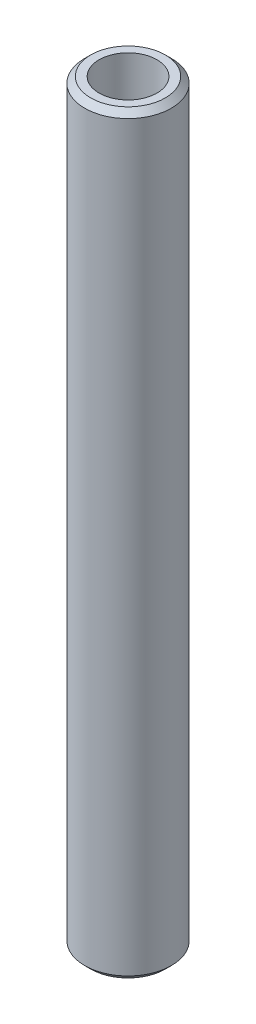
ISO-10303-21;
HEADER;
FILE_DESCRIPTION(('STEP AP214'),'2;1');
FILE_NAME('part.step','',(''),(''),'','','');
FILE_SCHEMA(('AUTOMOTIVE_DESIGN { 1 0 10303 214 1 1 1 1 }'));
ENDSEC;
DATA;
#1=APPLICATION_CONTEXT('core data for automotive mechanical design processes');
#2=APPLICATION_PROTOCOL_DEFINITION('international standard','automotive_design',2000,#1);
#3=PRODUCT_CONTEXT('',#1,'mechanical');
#4=PRODUCT('Part','Part','',(#3));
#5=PRODUCT_RELATED_PRODUCT_CATEGORY('part','',(#4));
#6=PRODUCT_DEFINITION_FORMATION('','',#4);
#7=PRODUCT_DEFINITION_CONTEXT('part definition',#1,'design');
#8=PRODUCT_DEFINITION('design','',#6,#7);
#9=PRODUCT_DEFINITION_SHAPE('','',#8);
#10=(LENGTH_UNIT() NAMED_UNIT(*) SI_UNIT(.MILLI.,.METRE.));
#11=(NAMED_UNIT(*) PLANE_ANGLE_UNIT() SI_UNIT($,.RADIAN.));
#12=(NAMED_UNIT(*) SI_UNIT($,.STERADIAN.) SOLID_ANGLE_UNIT());
#13=UNCERTAINTY_MEASURE_WITH_UNIT(LENGTH_MEASURE(1.E-05),#10,'distance_accuracy_value','');
#14=(GEOMETRIC_REPRESENTATION_CONTEXT(3) GLOBAL_UNCERTAINTY_ASSIGNED_CONTEXT((#13)) GLOBAL_UNIT_ASSIGNED_CONTEXT((#10,
#11,#12)) REPRESENTATION_CONTEXT('',''));
#15=CARTESIAN_POINT('',(0.,0.,0.));
#16=DIRECTION('',(0.,0.,1.));
#17=DIRECTION('',(1.,0.,0.));
#18=AXIS2_PLACEMENT_3D('',#15,#16,#17);
#19=CARTESIAN_POINT('',(0.,435.950441471467,0.));
#20=DIRECTION('',(0.,-1.,0.));
#21=DIRECTION('',(0.,0.,-1.));
#22=AXIS2_PLACEMENT_3D('',#19,#20,#21);
#23=CYLINDRICAL_SURFACE('',#22,25.);
#24=CARTESIAN_POINT('',(0.,432.499623451648,0.));
#25=DIRECTION('',(0.,1.,0.));
#26=DIRECTION('',(0.,0.,1.));
#27=AXIS2_PLACEMENT_3D('',#24,#25,#26);
#28=CIRCLE('',#27,25.);
#29=CARTESIAN_POINT('',(0.,432.499623451648,-25.));
#30=VERTEX_POINT('',#29);
#31=EDGE_CURVE('E50',#30,#30,#28,.F.);
#32=CARTESIAN_POINT('',(0.,3.45081801981934,0.));
#33=DIRECTION('',(0.,1.,0.));
#34=DIRECTION('',(0.,0.,1.));
#35=AXIS2_PLACEMENT_3D('',#32,#33,#34);
#36=CIRCLE('',#35,25.);
#37=CARTESIAN_POINT('',(0.,3.45081801981934,-25.));
#38=VERTEX_POINT('',#37);
#39=EDGE_CURVE('E51',#38,#38,#36,.T.);
#40=CARTESIAN_POINT('',(0.,432.499623451648,-25.));
#41=CARTESIAN_POINT('',(0.,428.030365061733,-25.));
#42=CARTESIAN_POINT('',(0.,423.561106671819,-25.));
#43=CARTESIAN_POINT('',(0.,414.622589891989,-25.));
#44=CARTESIAN_POINT('',(0.,410.153331502074,-25.));
#45=CARTESIAN_POINT('',(0.,401.214814722244,-25.));
#46=CARTESIAN_POINT('',(0.,396.745556332329,-25.));
#47=CARTESIAN_POINT('',(0.,387.8070395525,-25.));
#48=CARTESIAN_POINT('',(0.,383.337781162585,-25.));
#49=CARTESIAN_POINT('',(0.,374.399264382755,-25.));
#50=CARTESIAN_POINT('',(0.,369.93000599284,-25.));
#51=CARTESIAN_POINT('',(0.,360.99148921301,-25.));
#52=CARTESIAN_POINT('',(0.,356.522230823095,-25.));
#53=CARTESIAN_POINT('',(0.,347.583714043266,-25.));
#54=CARTESIAN_POINT('',(0.,343.114455653351,-25.));
#55=CARTESIAN_POINT('',(0.,334.175938873521,-25.));
#56=CARTESIAN_POINT('',(0.,329.706680483606,-25.));
#57=CARTESIAN_POINT('',(0.,320.768163703776,-25.));
#58=CARTESIAN_POINT('',(0.,316.298905313861,-25.));
#59=CARTESIAN_POINT('',(0.,307.360388534032,-25.));
#60=CARTESIAN_POINT('',(0.,302.891130144117,-25.));
#61=CARTESIAN_POINT('',(0.,293.952613364287,-25.));
#62=CARTESIAN_POINT('',(0.,289.483354974372,-25.));
#63=CARTESIAN_POINT('',(0.,280.544838194542,-25.));
#64=CARTESIAN_POINT('',(0.,276.075579804627,-25.));
#65=CARTESIAN_POINT('',(0.,267.137063024798,-25.));
#66=CARTESIAN_POINT('',(0.,262.667804634883,-25.));
#67=CARTESIAN_POINT('',(0.,253.729287855053,-25.));
#68=CARTESIAN_POINT('',(0.,249.260029465138,-25.));
#69=CARTESIAN_POINT('',(0.,240.321512685308,-25.));
#70=CARTESIAN_POINT('',(0.,235.852254295393,-25.));
#71=CARTESIAN_POINT('',(0.,226.913737515564,-25.));
#72=CARTESIAN_POINT('',(0.,222.444479125649,-25.));
#73=CARTESIAN_POINT('',(0.,213.505962345819,-25.));
#74=CARTESIAN_POINT('',(0.,209.036703955904,-25.));
#75=CARTESIAN_POINT('',(0.,200.098187176074,-25.));
#76=CARTESIAN_POINT('',(0.,195.628928786159,-25.));
#77=CARTESIAN_POINT('',(0.,186.69041200633,-25.));
#78=CARTESIAN_POINT('',(0.,182.221153616415,-25.));
#79=CARTESIAN_POINT('',(0.,173.282636836585,-25.));
#80=CARTESIAN_POINT('',(0.,168.81337844667,-25.));
#81=CARTESIAN_POINT('',(0.,159.87486166684,-25.));
#82=CARTESIAN_POINT('',(0.,155.405603276925,-25.));
#83=CARTESIAN_POINT('',(0.,146.467086497096,-25.));
#84=CARTESIAN_POINT('',(0.,141.997828107181,-25.));
#85=CARTESIAN_POINT('',(0.,133.059311327351,-25.));
#86=CARTESIAN_POINT('',(0.,128.590052937436,-25.));
#87=CARTESIAN_POINT('',(0.,119.651536157606,-25.));
#88=CARTESIAN_POINT('',(0.,115.182277767691,-25.));
#89=CARTESIAN_POINT('',(0.,106.243760987862,-25.));
#90=CARTESIAN_POINT('',(0.,101.774502597947,-25.));
#91=CARTESIAN_POINT('',(0.,92.835985818117,-25.));
#92=CARTESIAN_POINT('',(0.,88.3667274282022,-25.));
#93=CARTESIAN_POINT('',(0.,79.4282106483724,-25.));
#94=CARTESIAN_POINT('',(0.,74.9589522584575,-25.));
#95=CARTESIAN_POINT('',(0.,66.0204354786277,-25.));
#96=CARTESIAN_POINT('',(0.,61.5511770887129,-25.));
#97=CARTESIAN_POINT('',(0.,52.6126603088831,-25.));
#98=CARTESIAN_POINT('',(0.,48.1434019189682,-25.));
#99=CARTESIAN_POINT('',(0.,39.2048851391384,-25.));
#100=CARTESIAN_POINT('',(0.,34.7356267492235,-25.));
#101=CARTESIAN_POINT('',(0.,25.7971099693938,-25.));
#102=CARTESIAN_POINT('',(0.,21.3278515794789,-25.));
#103=CARTESIAN_POINT('',(0.,12.3893347996491,-25.));
#104=CARTESIAN_POINT('',(0.,7.92007640973423,-25.));
#105=CARTESIAN_POINT('',(0.,3.45081801981934,-25.));
#106=B_SPLINE_CURVE_WITH_KNOTS('',3,(#40,#41,#42,#43,#44,#45,#46,#47,#48,#49,#50,#51,#52,#53,
#54,#55,#56,#57,#58,#59,#60,#61,#62,#63,#64,#65,#66,#67,#68,#69,#70,#71,#72,#73,#74,#75,#76,#77,
#78,#79,#80,#81,#82,#83,#84,#85,#86,#87,#88,#89,#90,#91,#92,#93,#94,#95,#96,#97,#98,#99,#100,
#101,#102,#103,#104,#105),.UNSPECIFIED.,.F.,.F.,(4,2,2,2,2,2,2,2,2,2,2,2,2,2,2,2,2,2,2,2,2,2,2,
2,2,2,2,2,2,2,2,2,4),(0.,13.4077751697446,26.8155503394893,40.223325509234,53.6311006789786,
67.0388758487233,80.4466510184679,93.8544261882125,107.262201357957,120.669976527702,
134.077751697447,147.485526867191,160.893302036936,174.30107720668,187.708852376425,
201.11662754617,214.524402715914,227.932177885659,241.339953055404,254.747728225148,
268.155503394893,281.563278564638,294.971053734382,308.378828904127,321.786604073872,
335.194379243616,348.602154413361,362.009929583106,375.41770475285,388.825479922595,
402.23325509234,415.641030262084,429.048805431829),.UNSPECIFIED.);
#107=EDGE_CURVE('BSEAM39',#30,#38,#106,.T.);
#108=ORIENTED_EDGE('',*,*,#31,.T.);
#109=ORIENTED_EDGE('',*,*,#39,.T.);
#110=ORIENTED_EDGE('',*,*,#107,.T.);
#111=ORIENTED_EDGE('',*,*,#107,.F.);
#112=EDGE_LOOP('',(#108,#110,#109,#111));
#113=FACE_BOUND('',#112,.T.);
#114=ADVANCED_FACE('F39',(#113),#23,.T.);
#115=CARTESIAN_POINT('',(0.,435.950441471467,0.));
#116=DIRECTION('',(0.,1.,0.));
#117=DIRECTION('',(0.,0.,1.));
#118=AXIS2_PLACEMENT_3D('',#115,#116,#117);
#119=PLANE('',#118);
#120=CARTESIAN_POINT('',(0.,435.950441471467,0.));
#121=DIRECTION('',(0.,1.,0.));
#122=DIRECTION('',(0.,0.,1.));
#123=AXIS2_PLACEMENT_3D('',#120,#121,#122);
#124=CIRCLE('',#123,21.5491819801813);
#125=CARTESIAN_POINT('',(0.,435.950441471467,21.5491819801813));
#126=VERTEX_POINT('',#125);
#127=EDGE_CURVE('E54',#126,#126,#124,.T.);
#128=ORIENTED_EDGE('',*,*,#127,.T.);
#129=EDGE_LOOP('',(#128));
#130=FACE_BOUND('',#129,.T.);
#131=CARTESIAN_POINT('',(0.,435.950441471467,0.));
#132=DIRECTION('',(0.,1.,0.));
#133=DIRECTION('',(0.,0.,1.));
#134=AXIS2_PLACEMENT_3D('',#131,#132,#133);
#135=CIRCLE('',#134,16.7165979547188);
#136=CARTESIAN_POINT('',(0.,435.950441471467,-16.7165979547188));
#137=VERTEX_POINT('',#136);
#138=EDGE_CURVE('E58',#137,#137,#135,.T.);
#139=ORIENTED_EDGE('',*,*,#138,.F.);
#140=EDGE_LOOP('',(#139));
#141=FACE_BOUND('',#140,.T.);
#142=ADVANCED_FACE('F69',(#130,#141),#119,.T.);
#143=CARTESIAN_POINT('',(0.,0.,0.));
#144=DIRECTION('',(0.,1.,0.));
#145=DIRECTION('',(0.,0.,1.));
#146=AXIS2_PLACEMENT_3D('',#143,#144,#145);
#147=PLANE('',#146);
#148=CARTESIAN_POINT('',(0.,0.,0.));
#149=DIRECTION('',(0.,1.,0.));
#150=DIRECTION('',(0.,0.,1.));
#151=AXIS2_PLACEMENT_3D('',#148,#149,#150);
#152=CIRCLE('',#151,21.5491819801807);
#153=CARTESIAN_POINT('',(0.,0.,21.5491819801807));
#154=VERTEX_POINT('',#153);
#155=EDGE_CURVE('E10',#154,#154,#152,.F.);
#156=ORIENTED_EDGE('',*,*,#155,.T.);
#157=EDGE_LOOP('',(#156));
#158=FACE_BOUND('',#157,.T.);
#159=CARTESIAN_POINT('',(0.,0.,0.));
#160=DIRECTION('',(0.,1.,0.));
#161=DIRECTION('',(0.,0.,1.));
#162=AXIS2_PLACEMENT_3D('',#159,#160,#161);
#163=CIRCLE('',#162,16.7165979547188);
#164=CARTESIAN_POINT('',(0.,0.,-16.7165979547188));
#165=VERTEX_POINT('',#164);
#166=EDGE_CURVE('E63',#165,#165,#163,.T.);
#167=ORIENTED_EDGE('',*,*,#166,.T.);
#168=EDGE_LOOP('',(#167));
#169=FACE_BOUND('',#168,.T.);
#170=ADVANCED_FACE('F75',(#158,#169),#147,.F.);
#171=CARTESIAN_POINT('',(0.,435.950441471467,0.));
#172=DIRECTION('',(0.,-1.,0.));
#173=DIRECTION('',(0.,0.,-1.));
#174=AXIS2_PLACEMENT_3D('',#171,#172,#173);
#175=CYLINDRICAL_SURFACE('',#174,16.7165979547188);
#176=CARTESIAN_POINT('',(0.,435.950441471467,-16.7165979547188));
#177=CARTESIAN_POINT('',(0.,431.409291039473,-16.7165979547188));
#178=CARTESIAN_POINT('',(0.,426.868140607478,-16.7165979547188));
#179=CARTESIAN_POINT('',(0.,417.785839743489,-16.7165979547188));
#180=CARTESIAN_POINT('',(0.,413.244689311495,-16.7165979547188));
#181=CARTESIAN_POINT('',(0.,404.162388447506,-16.7165979547188));
#182=CARTESIAN_POINT('',(0.,399.621238015511,-16.7165979547188));
#183=CARTESIAN_POINT('',(0.,390.538937151523,-16.7165979547188));
#184=CARTESIAN_POINT('',(0.,385.997786719528,-16.7165979547188));
#185=CARTESIAN_POINT('',(0.,376.915485855539,-16.7165979547188));
#186=CARTESIAN_POINT('',(0.,372.374335423545,-16.7165979547188));
#187=CARTESIAN_POINT('',(0.,363.292034559556,-16.7165979547188));
#188=CARTESIAN_POINT('',(0.,358.750884127561,-16.7165979547188));
#189=CARTESIAN_POINT('',(0.,349.668583263573,-16.7165979547188));
#190=CARTESIAN_POINT('',(0.,345.127432831578,-16.7165979547188));
#191=CARTESIAN_POINT('',(0.,336.045131967589,-16.7165979547188));
#192=CARTESIAN_POINT('',(0.,331.503981535595,-16.7165979547188));
#193=CARTESIAN_POINT('',(0.,322.421680671606,-16.7165979547188));
#194=CARTESIAN_POINT('',(0.,317.880530239611,-16.7165979547188));
#195=CARTESIAN_POINT('',(0.,308.798229375622,-16.7165979547188));
#196=CARTESIAN_POINT('',(0.,304.257078943628,-16.7165979547188));
#197=CARTESIAN_POINT('',(0.,295.174778079639,-16.7165979547188));
#198=CARTESIAN_POINT('',(0.,290.633627647645,-16.7165979547188));
#199=CARTESIAN_POINT('',(0.,281.551326783656,-16.7165979547188));
#200=CARTESIAN_POINT('',(0.,277.010176351661,-16.7165979547188));
#201=CARTESIAN_POINT('',(0.,267.927875487673,-16.7165979547188));
#202=CARTESIAN_POINT('',(0.,263.386725055678,-16.7165979547188));
#203=CARTESIAN_POINT('',(0.,254.304424191689,-16.7165979547188));
#204=CARTESIAN_POINT('',(0.,249.763273759695,-16.7165979547188));
#205=CARTESIAN_POINT('',(0.,240.680972895706,-16.7165979547188));
#206=CARTESIAN_POINT('',(0.,236.139822463711,-16.7165979547188));
#207=CARTESIAN_POINT('',(0.,227.057521599722,-16.7165979547188));
#208=CARTESIAN_POINT('',(0.,222.516371167728,-16.7165979547188));
#209=CARTESIAN_POINT('',(0.,213.434070303739,-16.7165979547188));
#210=CARTESIAN_POINT('',(0.,208.892919871745,-16.7165979547188));
#211=CARTESIAN_POINT('',(0.,199.810619007756,-16.7165979547188));
#212=CARTESIAN_POINT('',(0.,195.269468575761,-16.7165979547188));
#213=CARTESIAN_POINT('',(0.,186.187167711772,-16.7165979547188));
#214=CARTESIAN_POINT('',(0.,181.646017279778,-16.7165979547188));
#215=CARTESIAN_POINT('',(0.,172.563716415789,-16.7165979547188));
#216=CARTESIAN_POINT('',(0.,168.022565983795,-16.7165979547188));
#217=CARTESIAN_POINT('',(0.,158.940265119806,-16.7165979547188));
#218=CARTESIAN_POINT('',(0.,154.399114687811,-16.7165979547188));
#219=CARTESIAN_POINT('',(0.,145.316813823822,-16.7165979547188));
#220=CARTESIAN_POINT('',(0.,140.775663391828,-16.7165979547188));
#221=CARTESIAN_POINT('',(0.,131.693362527839,-16.7165979547188));
#222=CARTESIAN_POINT('',(0.,127.152212095845,-16.7165979547188));
#223=CARTESIAN_POINT('',(0.,118.069911231856,-16.7165979547188));
#224=CARTESIAN_POINT('',(0.,113.528760799861,-16.7165979547188));
#225=CARTESIAN_POINT('',(0.,104.446459935872,-16.7165979547188));
#226=CARTESIAN_POINT('',(0.,99.9053095038778,-16.7165979547188));
#227=CARTESIAN_POINT('',(0.,90.8230086398889,-16.7165979547188));
#228=CARTESIAN_POINT('',(0.,86.2818582078945,-16.7165979547188));
#229=CARTESIAN_POINT('',(0.,77.1995573439056,-16.7165979547188));
#230=CARTESIAN_POINT('',(0.,72.6584069119111,-16.7165979547188));
#231=CARTESIAN_POINT('',(0.,63.5761060479222,-16.7165979547188));
#232=CARTESIAN_POINT('',(0.,59.0349556159278,-16.7165979547188));
#233=CARTESIAN_POINT('',(0.,49.9526547519389,-16.7165979547188));
#234=CARTESIAN_POINT('',(0.,45.4115043199444,-16.7165979547188));
#235=CARTESIAN_POINT('',(0.,36.3292034559556,-16.7165979547188));
#236=CARTESIAN_POINT('',(0.,31.7880530239611,-16.7165979547188));
#237=CARTESIAN_POINT('',(0.,22.7057521599722,-16.7165979547188));
#238=CARTESIAN_POINT('',(0.,18.1646017279778,-16.7165979547188));
#239=CARTESIAN_POINT('',(0.,9.08230086398885,-16.7165979547188));
#240=CARTESIAN_POINT('',(0.,4.54115043199439,-16.7165979547188));
#241=CARTESIAN_POINT('',(0.,0.,-16.7165979547188));
#242=B_SPLINE_CURVE_WITH_KNOTS('',3,(#176,#177,#178,#179,#180,#181,#182,#183,#184,#185,#186,
#187,#188,#189,#190,#191,#192,#193,#194,#195,#196,#197,#198,#199,#200,#201,#202,#203,#204,#205,
#206,#207,#208,#209,#210,#211,#212,#213,#214,#215,#216,#217,#218,#219,#220,#221,#222,#223,#224,
#225,#226,#227,#228,#229,#230,#231,#232,#233,#234,#235,#236,#237,#238,#239,#240,#241),
.UNSPECIFIED.,.F.,.F.,(4,2,2,2,2,2,2,2,2,2,2,2,2,2,2,2,2,2,2,2,2,2,2,2,2,2,2,2,2,2,2,2,4),(0.,
13.6234512959833,27.2469025919667,40.87035388795,54.4938051839334,68.1172564799167,
81.7407077759,95.3641590718834,108.987610367867,122.61106166385,136.234512959833,
149.857964255817,163.4814155518,177.104866847783,190.728318143767,204.35176943975,
217.975220735734,231.598672031717,245.2221233277,258.845574623684,272.469025919667,
286.09247721565,299.715928511634,313.339379807617,326.9628311036,340.586282399584,
354.209733695567,367.83318499155,381.456636287534,395.080087583517,408.7035388795,
422.326990175484,435.950441471467),.UNSPECIFIED.);
#243=EDGE_CURVE('BSEAM70',#137,#165,#242,.T.);
#244=ORIENTED_EDGE('',*,*,#138,.T.);
#245=ORIENTED_EDGE('',*,*,#166,.F.);
#246=ORIENTED_EDGE('',*,*,#243,.T.);
#247=ORIENTED_EDGE('',*,*,#243,.F.);
#248=EDGE_LOOP('',(#244,#246,#245,#247));
#249=FACE_BOUND('',#248,.T.);
#250=ADVANCED_FACE('F70',(#249),#175,.F.);
#251=CARTESIAN_POINT('',(0.,435.950441471467,0.));
#252=DIRECTION('',(0.,-1.,0.));
#253=DIRECTION('',(0.,0.,-1.));
#254=AXIS2_PLACEMENT_3D('',#251,#252,#253);
#255=CONICAL_SURFACE('',#254,21.5491819801813,0.785398163397446);
#256=ORIENTED_EDGE('',*,*,#31,.F.);
#257=EDGE_LOOP('',(#256));
#258=FACE_BOUND('',#257,.T.);
#259=ORIENTED_EDGE('',*,*,#127,.F.);
#260=EDGE_LOOP('',(#259));
#261=FACE_BOUND('',#260,.T.);
#262=ADVANCED_FACE('F81',(#258,#261),#255,.T.);
#263=CARTESIAN_POINT('',(0.,3.45081801981934,0.));
#264=DIRECTION('',(0.,1.,0.));
#265=DIRECTION('',(0.,0.,1.));
#266=AXIS2_PLACEMENT_3D('',#263,#264,#265);
#267=CONICAL_SURFACE('',#266,25.,0.785398163397446);
#268=ORIENTED_EDGE('',*,*,#155,.F.);
#269=EDGE_LOOP('',(#268));
#270=FACE_BOUND('',#269,.T.);
#271=ORIENTED_EDGE('',*,*,#39,.F.);
#272=EDGE_LOOP('',(#271));
#273=FACE_BOUND('',#272,.T.);
#274=ADVANCED_FACE('F45',(#270,#273),#267,.T.);
#275=CLOSED_SHELL('',(#114,#142,#170,#250,#262,#274));
#276=MANIFOLD_SOLID_BREP('B2',#275);
#277=ADVANCED_BREP_SHAPE_REPRESENTATION('',(#18,#276),#14);
#278=SHAPE_DEFINITION_REPRESENTATION(#9,#277);
ENDSEC;
END-ISO-10303-21;
